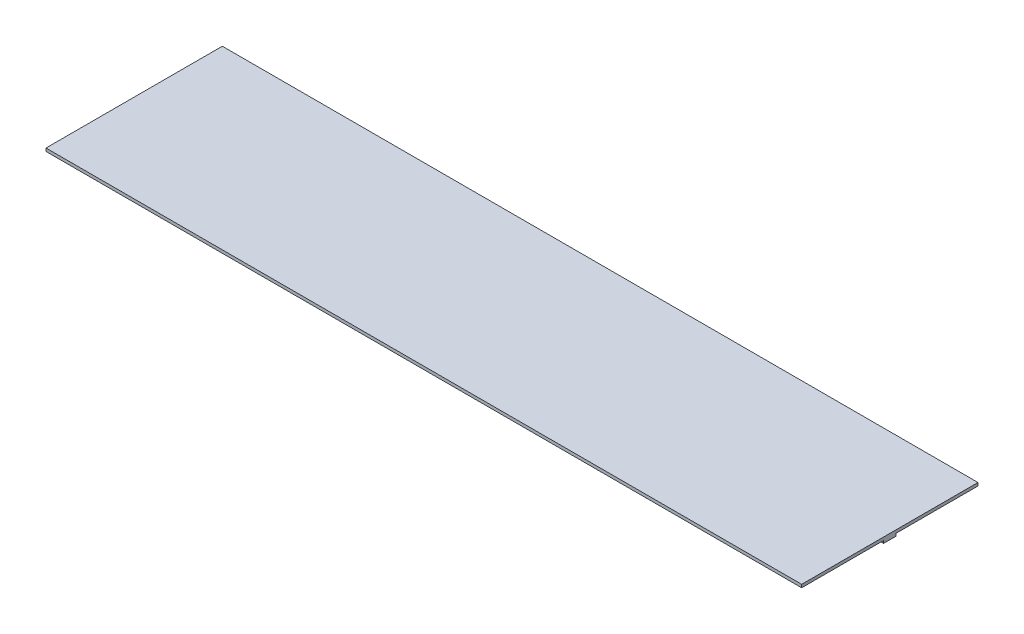
ISO-10303-21;
HEADER;
FILE_DESCRIPTION(('STEP AP214'),'2;1');
FILE_NAME('part.step','',(''),(''),'','','');
FILE_SCHEMA(('AUTOMOTIVE_DESIGN { 1 0 10303 214 1 1 1 1 }'));
ENDSEC;
DATA;
#1=APPLICATION_CONTEXT('core data for automotive mechanical design processes');
#2=APPLICATION_PROTOCOL_DEFINITION('international standard','automotive_design',2000,#1);
#3=PRODUCT_CONTEXT('',#1,'mechanical');
#4=PRODUCT('Part','Part','',(#3));
#5=PRODUCT_RELATED_PRODUCT_CATEGORY('part','',(#4));
#6=PRODUCT_DEFINITION_FORMATION('','',#4);
#7=PRODUCT_DEFINITION_CONTEXT('part definition',#1,'design');
#8=PRODUCT_DEFINITION('design','',#6,#7);
#9=PRODUCT_DEFINITION_SHAPE('','',#8);
#10=(LENGTH_UNIT() NAMED_UNIT(*) SI_UNIT(.MILLI.,.METRE.));
#11=(NAMED_UNIT(*) PLANE_ANGLE_UNIT() SI_UNIT($,.RADIAN.));
#12=(NAMED_UNIT(*) SI_UNIT($,.STERADIAN.) SOLID_ANGLE_UNIT());
#13=UNCERTAINTY_MEASURE_WITH_UNIT(LENGTH_MEASURE(1.E-05),#10,'distance_accuracy_value','');
#14=(GEOMETRIC_REPRESENTATION_CONTEXT(3) GLOBAL_UNCERTAINTY_ASSIGNED_CONTEXT((#13)) GLOBAL_UNIT_ASSIGNED_CONTEXT((#10,
#11,#12)) REPRESENTATION_CONTEXT('',''));
#15=CARTESIAN_POINT('',(0.,0.,0.));
#16=DIRECTION('',(0.,0.,1.));
#17=DIRECTION('',(1.,0.,0.));
#18=AXIS2_PLACEMENT_3D('',#15,#16,#17);
#19=CARTESIAN_POINT('',(0.,0.,0.));
#20=DIRECTION('',(0.,-1.,0.));
#21=DIRECTION('',(0.,0.,-1.));
#22=AXIS2_PLACEMENT_3D('',#19,#20,#21);
#23=PLANE('',#22);
#24=DIRECTION('',(0.,0.,1.));
#25=VECTOR('',#24,1.);
#26=CARTESIAN_POINT('',(-29.5,0.,3.75));
#27=LINE('',#26,#25);
#28=CARTESIAN_POINT('',(-29.5,0.,3.25));
#29=VERTEX_POINT('',#28);
#30=CARTESIAN_POINT('',(-29.5,0.,3.75));
#31=VERTEX_POINT('',#30);
#32=EDGE_CURVE('E211',#29,#31,#27,.T.);
#33=ORIENTED_EDGE('',*,*,#32,.F.);
#34=DIRECTION('',(1.,0.,0.));
#35=VECTOR('',#34,1.);
#36=CARTESIAN_POINT('',(-30.,0.,3.25));
#37=LINE('',#36,#35);
#38=CARTESIAN_POINT('',(-30.,0.,3.25));
#39=VERTEX_POINT('',#38);
#40=EDGE_CURVE('E209',#39,#29,#37,.T.);
#41=ORIENTED_EDGE('',*,*,#40,.F.);
#42=DIRECTION('',(0.,0.,1.));
#43=VECTOR('',#42,1.);
#44=CARTESIAN_POINT('',(-30.,0.,0.));
#45=LINE('',#44,#43);
#46=CARTESIAN_POINT('',(-30.,0.,0.));
#47=VERTEX_POINT('',#46);
#48=EDGE_CURVE('E147',#47,#39,#45,.T.);
#49=ORIENTED_EDGE('',*,*,#48,.F.);
#50=DIRECTION('',(-1.,0.,0.));
#51=VECTOR('',#50,1.);
#52=CARTESIAN_POINT('',(0.,0.,0.));
#53=LINE('',#52,#51);
#54=CARTESIAN_POINT('',(0.,0.,0.));
#55=VERTEX_POINT('',#54);
#56=EDGE_CURVE('E194',#55,#47,#53,.T.);
#57=ORIENTED_EDGE('',*,*,#56,.F.);
#58=DIRECTION('',(0.,0.,-1.));
#59=VECTOR('',#58,1.);
#60=CARTESIAN_POINT('',(0.,0.,0.));
#61=LINE('',#60,#59);
#62=CARTESIAN_POINT('',(0.,0.,3.25));
#63=VERTEX_POINT('',#62);
#64=EDGE_CURVE('E179',#63,#55,#61,.T.);
#65=ORIENTED_EDGE('',*,*,#64,.F.);
#66=DIRECTION('',(1.,0.,0.));
#67=VECTOR('',#66,1.);
#68=CARTESIAN_POINT('',(0.,0.,3.25));
#69=LINE('',#68,#67);
#70=CARTESIAN_POINT('',(-0.499999999999999,0.,3.25));
#71=VERTEX_POINT('',#70);
#72=EDGE_CURVE('E56',#71,#63,#69,.T.);
#73=ORIENTED_EDGE('',*,*,#72,.F.);
#74=DIRECTION('',(0.,0.,-1.));
#75=VECTOR('',#74,1.);
#76=CARTESIAN_POINT('',(-0.499999999999999,0.,3.75));
#77=LINE('',#76,#75);
#78=CARTESIAN_POINT('',(-0.499999999999999,0.,3.75));
#79=VERTEX_POINT('',#78);
#80=EDGE_CURVE('E151',#79,#71,#77,.T.);
#81=ORIENTED_EDGE('',*,*,#80,.F.);
#82=DIRECTION('',(-1.,0.,0.));
#83=VECTOR('',#82,1.);
#84=CARTESIAN_POINT('',(0.,0.,3.75));
#85=LINE('',#84,#83);
#86=CARTESIAN_POINT('',(0.,0.,3.75));
#87=VERTEX_POINT('',#86);
#88=EDGE_CURVE('E148',#87,#79,#85,.T.);
#89=ORIENTED_EDGE('',*,*,#88,.F.);
#90=CARTESIAN_POINT('',(0.,0.,7.));
#91=VERTEX_POINT('',#90);
#92=EDGE_CURVE('E191',#91,#87,#61,.T.);
#93=ORIENTED_EDGE('',*,*,#92,.F.);
#94=DIRECTION('',(1.,0.,0.));
#95=VECTOR('',#94,1.);
#96=CARTESIAN_POINT('',(0.,0.,7.));
#97=LINE('',#96,#95);
#98=CARTESIAN_POINT('',(-30.,0.,7.));
#99=VERTEX_POINT('',#98);
#100=EDGE_CURVE('E184',#99,#91,#97,.T.);
#101=ORIENTED_EDGE('',*,*,#100,.F.);
#102=CARTESIAN_POINT('',(-30.,0.,3.75));
#103=VERTEX_POINT('',#102);
#104=EDGE_CURVE('E196',#103,#99,#45,.T.);
#105=ORIENTED_EDGE('',*,*,#104,.F.);
#106=DIRECTION('',(-1.,0.,0.));
#107=VECTOR('',#106,1.);
#108=CARTESIAN_POINT('',(-30.,0.,3.75));
#109=LINE('',#108,#107);
#110=EDGE_CURVE('E141',#31,#103,#109,.T.);
#111=ORIENTED_EDGE('',*,*,#110,.F.);
#112=EDGE_LOOP('',(#33,#41,#49,#57,#65,#73,#81,#89,#93,#101,#105,#111));
#113=FACE_BOUND('',#112,.T.);
#114=ADVANCED_FACE('F33',(#113),#23,.T.);
#115=CARTESIAN_POINT('',(0.,0.12,0.));
#116=DIRECTION('',(-1.,0.,0.));
#117=DIRECTION('',(0.,0.,1.));
#118=AXIS2_PLACEMENT_3D('',#115,#116,#117);
#119=PLANE('',#118);
#120=ORIENTED_EDGE('',*,*,#92,.T.);
#121=DIRECTION('',(0.,1.,0.));
#122=VECTOR('',#121,1.);
#123=CARTESIAN_POINT('',(0.,-0.1,3.75));
#124=LINE('',#123,#122);
#125=CARTESIAN_POINT('',(0.,-0.1,3.75));
#126=VERTEX_POINT('',#125);
#127=EDGE_CURVE('E176',#126,#87,#124,.T.);
#128=ORIENTED_EDGE('',*,*,#127,.F.);
#129=DIRECTION('',(0.,0.,1.));
#130=VECTOR('',#129,1.);
#131=CARTESIAN_POINT('',(0.,-0.1,3.75));
#132=LINE('',#131,#130);
#133=CARTESIAN_POINT('',(0.,-0.1,3.25));
#134=VERTEX_POINT('',#133);
#135=EDGE_CURVE('E156',#134,#126,#132,.T.);
#136=ORIENTED_EDGE('',*,*,#135,.F.);
#137=DIRECTION('',(0.,1.,0.));
#138=VECTOR('',#137,1.);
#139=CARTESIAN_POINT('',(0.,-0.1,3.25));
#140=LINE('',#139,#138);
#141=EDGE_CURVE('E164',#134,#63,#140,.T.);
#142=ORIENTED_EDGE('',*,*,#141,.T.);
#143=ORIENTED_EDGE('',*,*,#64,.T.);
#144=DIRECTION('',(0.,-1.,0.));
#145=VECTOR('',#144,1.);
#146=CARTESIAN_POINT('',(0.,0.12,0.));
#147=LINE('',#146,#145);
#148=CARTESIAN_POINT('',(0.,0.12,0.));
#149=VERTEX_POINT('',#148);
#150=EDGE_CURVE('E11',#149,#55,#147,.T.);
#151=ORIENTED_EDGE('',*,*,#150,.F.);
#152=DIRECTION('',(0.,0.,-1.));
#153=VECTOR('',#152,1.);
#154=CARTESIAN_POINT('',(0.,0.12,0.));
#155=LINE('',#154,#153);
#156=CARTESIAN_POINT('',(0.,0.12,7.));
#157=VERTEX_POINT('',#156);
#158=EDGE_CURVE('E180',#157,#149,#155,.T.);
#159=ORIENTED_EDGE('',*,*,#158,.F.);
#160=DIRECTION('',(0.,-1.,0.));
#161=VECTOR('',#160,1.);
#162=CARTESIAN_POINT('',(0.,0.12,7.));
#163=LINE('',#162,#161);
#164=EDGE_CURVE('E190',#157,#91,#163,.T.);
#165=ORIENTED_EDGE('',*,*,#164,.T.);
#166=EDGE_LOOP('',(#120,#128,#136,#142,#143,#151,#159,#165));
#167=FACE_BOUND('',#166,.T.);
#168=ADVANCED_FACE('F35',(#167),#119,.F.);
#169=CARTESIAN_POINT('',(0.,0.12,0.));
#170=DIRECTION('',(0.,0.,1.));
#171=DIRECTION('',(1.,0.,0.));
#172=AXIS2_PLACEMENT_3D('',#169,#170,#171);
#173=PLANE('',#172);
#174=ORIENTED_EDGE('',*,*,#56,.T.);
#175=DIRECTION('',(0.,-1.,0.));
#176=VECTOR('',#175,1.);
#177=CARTESIAN_POINT('',(-30.,0.12,0.));
#178=LINE('',#177,#176);
#179=CARTESIAN_POINT('',(-30.,0.12,0.));
#180=VERTEX_POINT('',#179);
#181=EDGE_CURVE('E41',#180,#47,#178,.T.);
#182=ORIENTED_EDGE('',*,*,#181,.F.);
#183=DIRECTION('',(-1.,0.,0.));
#184=VECTOR('',#183,1.);
#185=CARTESIAN_POINT('',(0.,0.12,0.));
#186=LINE('',#185,#184);
#187=EDGE_CURVE('E183',#149,#180,#186,.T.);
#188=ORIENTED_EDGE('',*,*,#187,.F.);
#189=ORIENTED_EDGE('',*,*,#150,.T.);
#190=EDGE_LOOP('',(#174,#182,#188,#189));
#191=FACE_BOUND('',#190,.T.);
#192=ADVANCED_FACE('F233',(#191),#173,.F.);
#193=CARTESIAN_POINT('',(-30.,0.12,0.));
#194=DIRECTION('',(1.,0.,0.));
#195=DIRECTION('',(0.,0.,-1.));
#196=AXIS2_PLACEMENT_3D('',#193,#194,#195);
#197=PLANE('',#196);
#198=ORIENTED_EDGE('',*,*,#48,.T.);
#199=DIRECTION('',(0.,1.,0.));
#200=VECTOR('',#199,1.);
#201=CARTESIAN_POINT('',(-30.,-0.1,3.25));
#202=LINE('',#201,#200);
#203=CARTESIAN_POINT('',(-30.,-0.1,3.25));
#204=VERTEX_POINT('',#203);
#205=EDGE_CURVE('E126',#204,#39,#202,.T.);
#206=ORIENTED_EDGE('',*,*,#205,.F.);
#207=DIRECTION('',(0.,0.,-1.));
#208=VECTOR('',#207,1.);
#209=CARTESIAN_POINT('',(-30.,-0.1,3.75));
#210=LINE('',#209,#208);
#211=CARTESIAN_POINT('',(-30.,-0.1,3.75));
#212=VERTEX_POINT('',#211);
#213=EDGE_CURVE('E133',#212,#204,#210,.T.);
#214=ORIENTED_EDGE('',*,*,#213,.F.);
#215=DIRECTION('',(0.,1.,0.));
#216=VECTOR('',#215,1.);
#217=CARTESIAN_POINT('',(-30.,-0.1,3.75));
#218=LINE('',#217,#216);
#219=EDGE_CURVE('E218',#212,#103,#218,.T.);
#220=ORIENTED_EDGE('',*,*,#219,.T.);
#221=ORIENTED_EDGE('',*,*,#104,.T.);
#222=DIRECTION('',(0.,-1.,0.));
#223=VECTOR('',#222,1.);
#224=CARTESIAN_POINT('',(-30.,0.12,7.));
#225=LINE('',#224,#223);
#226=CARTESIAN_POINT('',(-30.,0.12,7.));
#227=VERTEX_POINT('',#226);
#228=EDGE_CURVE('E201',#227,#99,#225,.T.);
#229=ORIENTED_EDGE('',*,*,#228,.F.);
#230=DIRECTION('',(0.,0.,1.));
#231=VECTOR('',#230,1.);
#232=CARTESIAN_POINT('',(-30.,0.12,0.));
#233=LINE('',#232,#231);
#234=EDGE_CURVE('E186',#180,#227,#233,.T.);
#235=ORIENTED_EDGE('',*,*,#234,.F.);
#236=ORIENTED_EDGE('',*,*,#181,.T.);
#237=EDGE_LOOP('',(#198,#206,#214,#220,#221,#229,#235,#236));
#238=FACE_BOUND('',#237,.T.);
#239=ADVANCED_FACE('F144',(#238),#197,.F.);
#240=CARTESIAN_POINT('',(0.,0.12,7.));
#241=DIRECTION('',(0.,0.,-1.));
#242=DIRECTION('',(-1.,0.,0.));
#243=AXIS2_PLACEMENT_3D('',#240,#241,#242);
#244=PLANE('',#243);
#245=ORIENTED_EDGE('',*,*,#100,.T.);
#246=ORIENTED_EDGE('',*,*,#164,.F.);
#247=DIRECTION('',(1.,0.,0.));
#248=VECTOR('',#247,1.);
#249=CARTESIAN_POINT('',(0.,0.12,7.));
#250=LINE('',#249,#248);
#251=EDGE_CURVE('E188',#227,#157,#250,.T.);
#252=ORIENTED_EDGE('',*,*,#251,.F.);
#253=ORIENTED_EDGE('',*,*,#228,.T.);
#254=EDGE_LOOP('',(#245,#246,#252,#253));
#255=FACE_BOUND('',#254,.T.);
#256=ADVANCED_FACE('F227',(#255),#244,.F.);
#257=CARTESIAN_POINT('',(0.,0.12,0.));
#258=DIRECTION('',(0.,-1.,0.));
#259=DIRECTION('',(0.,0.,-1.));
#260=AXIS2_PLACEMENT_3D('',#257,#258,#259);
#261=PLANE('',#260);
#262=ORIENTED_EDGE('',*,*,#158,.T.);
#263=ORIENTED_EDGE('',*,*,#187,.T.);
#264=ORIENTED_EDGE('',*,*,#234,.T.);
#265=ORIENTED_EDGE('',*,*,#251,.T.);
#266=EDGE_LOOP('',(#262,#263,#264,#265));
#267=FACE_BOUND('',#266,.T.);
#268=ADVANCED_FACE('F231',(#267),#261,.F.);
#269=CARTESIAN_POINT('',(0.,-0.1,3.75));
#270=DIRECTION('',(0.,0.,-1.));
#271=DIRECTION('',(-1.,0.,0.));
#272=AXIS2_PLACEMENT_3D('',#269,#270,#271);
#273=PLANE('',#272);
#274=ORIENTED_EDGE('',*,*,#88,.T.);
#275=DIRECTION('',(0.,1.,0.));
#276=VECTOR('',#275,1.);
#277=CARTESIAN_POINT('',(-0.499999999999999,-0.1,3.75));
#278=LINE('',#277,#276);
#279=CARTESIAN_POINT('',(-0.499999999999999,-0.1,3.75));
#280=VERTEX_POINT('',#279);
#281=EDGE_CURVE('E173',#280,#79,#278,.T.);
#282=ORIENTED_EDGE('',*,*,#281,.F.);
#283=DIRECTION('',(-1.,0.,0.));
#284=VECTOR('',#283,1.);
#285=CARTESIAN_POINT('',(0.,-0.1,3.75));
#286=LINE('',#285,#284);
#287=EDGE_CURVE('E159',#126,#280,#286,.T.);
#288=ORIENTED_EDGE('',*,*,#287,.F.);
#289=ORIENTED_EDGE('',*,*,#127,.T.);
#290=EDGE_LOOP('',(#274,#282,#288,#289));
#291=FACE_BOUND('',#290,.T.);
#292=ADVANCED_FACE('F246',(#291),#273,.F.);
#293=CARTESIAN_POINT('',(-0.499999999999999,-0.1,3.75));
#294=DIRECTION('',(1.,0.,0.));
#295=DIRECTION('',(0.,0.,-1.));
#296=AXIS2_PLACEMENT_3D('',#293,#294,#295);
#297=PLANE('',#296);
#298=ORIENTED_EDGE('',*,*,#80,.T.);
#299=DIRECTION('',(0.,1.,0.));
#300=VECTOR('',#299,1.);
#301=CARTESIAN_POINT('',(-0.499999999999999,-0.1,3.25));
#302=LINE('',#301,#300);
#303=CARTESIAN_POINT('',(-0.499999999999999,-0.1,3.25));
#304=VERTEX_POINT('',#303);
#305=EDGE_CURVE('E170',#304,#71,#302,.T.);
#306=ORIENTED_EDGE('',*,*,#305,.F.);
#307=DIRECTION('',(0.,0.,-1.));
#308=VECTOR('',#307,1.);
#309=CARTESIAN_POINT('',(-0.499999999999999,-0.1,3.75));
#310=LINE('',#309,#308);
#311=EDGE_CURVE('E161',#280,#304,#310,.T.);
#312=ORIENTED_EDGE('',*,*,#311,.F.);
#313=ORIENTED_EDGE('',*,*,#281,.T.);
#314=EDGE_LOOP('',(#298,#306,#312,#313));
#315=FACE_BOUND('',#314,.T.);
#316=ADVANCED_FACE('F243',(#315),#297,.F.);
#317=CARTESIAN_POINT('',(0.,-0.1,3.25));
#318=DIRECTION('',(0.,0.,1.));
#319=DIRECTION('',(1.,0.,0.));
#320=AXIS2_PLACEMENT_3D('',#317,#318,#319);
#321=PLANE('',#320);
#322=ORIENTED_EDGE('',*,*,#72,.T.);
#323=ORIENTED_EDGE('',*,*,#141,.F.);
#324=DIRECTION('',(1.,0.,0.));
#325=VECTOR('',#324,1.);
#326=CARTESIAN_POINT('',(0.,-0.1,3.25));
#327=LINE('',#326,#325);
#328=EDGE_CURVE('E163',#304,#134,#327,.T.);
#329=ORIENTED_EDGE('',*,*,#328,.F.);
#330=ORIENTED_EDGE('',*,*,#305,.T.);
#331=EDGE_LOOP('',(#322,#323,#329,#330));
#332=FACE_BOUND('',#331,.T.);
#333=ADVANCED_FACE('F238',(#332),#321,.F.);
#334=CARTESIAN_POINT('',(0.,-0.1,0.));
#335=DIRECTION('',(0.,1.,0.));
#336=DIRECTION('',(0.,0.,1.));
#337=AXIS2_PLACEMENT_3D('',#334,#335,#336);
#338=PLANE('',#337);
#339=ORIENTED_EDGE('',*,*,#135,.T.);
#340=ORIENTED_EDGE('',*,*,#287,.T.);
#341=ORIENTED_EDGE('',*,*,#311,.T.);
#342=ORIENTED_EDGE('',*,*,#328,.T.);
#343=EDGE_LOOP('',(#339,#340,#341,#342));
#344=FACE_BOUND('',#343,.T.);
#345=ADVANCED_FACE('F249',(#344),#338,.F.);
#346=CARTESIAN_POINT('',(-30.,-0.1,3.25));
#347=DIRECTION('',(0.,0.,1.));
#348=DIRECTION('',(1.,0.,0.));
#349=AXIS2_PLACEMENT_3D('',#346,#347,#348);
#350=PLANE('',#349);
#351=ORIENTED_EDGE('',*,*,#40,.T.);
#352=DIRECTION('',(0.,1.,0.));
#353=VECTOR('',#352,1.);
#354=CARTESIAN_POINT('',(-29.5,-0.1,3.25));
#355=LINE('',#354,#353);
#356=CARTESIAN_POINT('',(-29.5,-0.1,3.25));
#357=VERTEX_POINT('',#356);
#358=EDGE_CURVE('E129',#357,#29,#355,.T.);
#359=ORIENTED_EDGE('',*,*,#358,.F.);
#360=DIRECTION('',(1.,0.,0.));
#361=VECTOR('',#360,1.);
#362=CARTESIAN_POINT('',(-30.,-0.1,3.25));
#363=LINE('',#362,#361);
#364=EDGE_CURVE('E122',#204,#357,#363,.T.);
#365=ORIENTED_EDGE('',*,*,#364,.F.);
#366=ORIENTED_EDGE('',*,*,#205,.T.);
#367=EDGE_LOOP('',(#351,#359,#365,#366));
#368=FACE_BOUND('',#367,.T.);
#369=ADVANCED_FACE('F124',(#368),#350,.F.);
#370=CARTESIAN_POINT('',(-29.5,-0.1,3.75));
#371=DIRECTION('',(-1.,0.,0.));
#372=DIRECTION('',(0.,0.,1.));
#373=AXIS2_PLACEMENT_3D('',#370,#371,#372);
#374=PLANE('',#373);
#375=ORIENTED_EDGE('',*,*,#32,.T.);
#376=DIRECTION('',(0.,1.,0.));
#377=VECTOR('',#376,1.);
#378=CARTESIAN_POINT('',(-29.5,-0.1,3.75));
#379=LINE('',#378,#377);
#380=CARTESIAN_POINT('',(-29.5,-0.1,3.75));
#381=VERTEX_POINT('',#380);
#382=EDGE_CURVE('E48',#381,#31,#379,.T.);
#383=ORIENTED_EDGE('',*,*,#382,.F.);
#384=DIRECTION('',(0.,0.,1.));
#385=VECTOR('',#384,1.);
#386=CARTESIAN_POINT('',(-29.5,-0.1,3.75));
#387=LINE('',#386,#385);
#388=EDGE_CURVE('E132',#357,#381,#387,.T.);
#389=ORIENTED_EDGE('',*,*,#388,.F.);
#390=ORIENTED_EDGE('',*,*,#358,.T.);
#391=EDGE_LOOP('',(#375,#383,#389,#390));
#392=FACE_BOUND('',#391,.T.);
#393=ADVANCED_FACE('F221',(#392),#374,.F.);
#394=CARTESIAN_POINT('',(-30.,-0.1,3.75));
#395=DIRECTION('',(0.,0.,-1.));
#396=DIRECTION('',(-1.,0.,0.));
#397=AXIS2_PLACEMENT_3D('',#394,#395,#396);
#398=PLANE('',#397);
#399=ORIENTED_EDGE('',*,*,#110,.T.);
#400=ORIENTED_EDGE('',*,*,#219,.F.);
#401=DIRECTION('',(-1.,0.,0.));
#402=VECTOR('',#401,1.);
#403=CARTESIAN_POINT('',(-30.,-0.1,3.75));
#404=LINE('',#403,#402);
#405=EDGE_CURVE('E137',#381,#212,#404,.T.);
#406=ORIENTED_EDGE('',*,*,#405,.F.);
#407=ORIENTED_EDGE('',*,*,#382,.T.);
#408=EDGE_LOOP('',(#399,#400,#406,#407));
#409=FACE_BOUND('',#408,.T.);
#410=ADVANCED_FACE('F222',(#409),#398,.F.);
#411=CARTESIAN_POINT('',(0.,-0.1,0.));
#412=DIRECTION('',(0.,-1.,0.));
#413=DIRECTION('',(0.,0.,-1.));
#414=AXIS2_PLACEMENT_3D('',#411,#412,#413);
#415=PLANE('',#414);
#416=ORIENTED_EDGE('',*,*,#213,.T.);
#417=ORIENTED_EDGE('',*,*,#364,.T.);
#418=ORIENTED_EDGE('',*,*,#388,.T.);
#419=ORIENTED_EDGE('',*,*,#405,.T.);
#420=EDGE_LOOP('',(#416,#417,#418,#419));
#421=FACE_BOUND('',#420,.T.);
#422=ADVANCED_FACE('F136',(#421),#415,.T.);
#423=CLOSED_SHELL('',(#114,#168,#192,#239,#256,#268,#292,#316,#333,#345,#369,#393,#410,#422));
#424=MANIFOLD_SOLID_BREP('B2',#423);
#425=ADVANCED_BREP_SHAPE_REPRESENTATION('',(#18,#424),#14);
#426=SHAPE_DEFINITION_REPRESENTATION(#9,#425);
ENDSEC;
END-ISO-10303-21;
